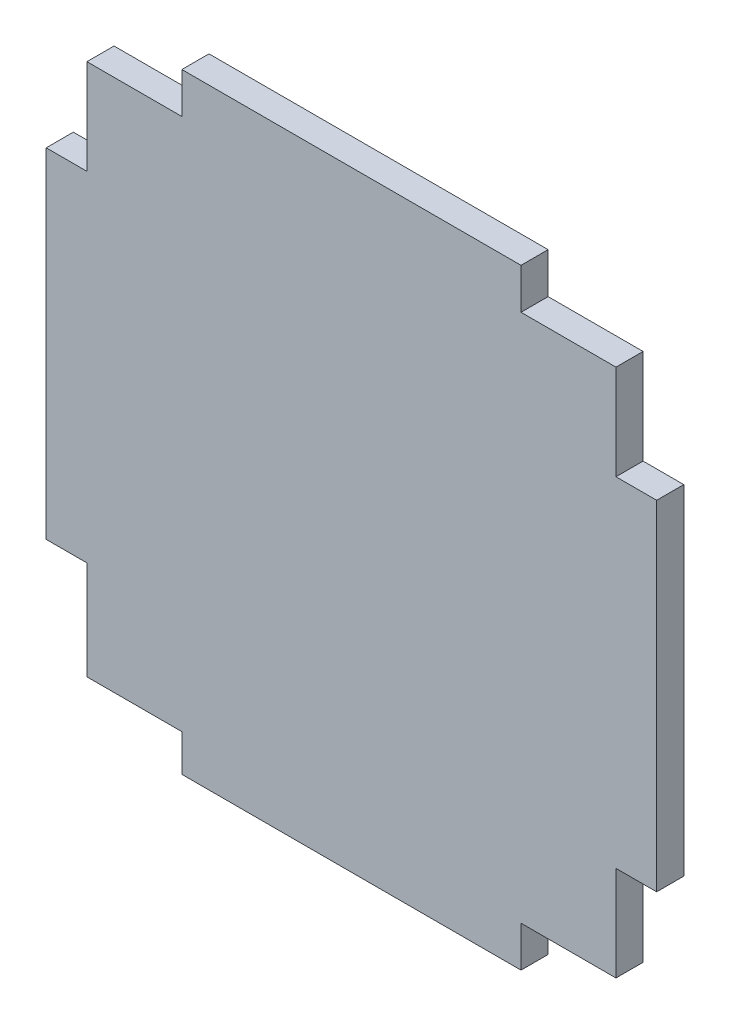
ISO-10303-21;
HEADER;
FILE_DESCRIPTION(('STEP AP214'),'2;1');
FILE_NAME('part.step','',(''),(''),'','','');
FILE_SCHEMA(('AUTOMOTIVE_DESIGN { 1 0 10303 214 1 1 1 1 }'));
ENDSEC;
DATA;
#1=APPLICATION_CONTEXT('core data for automotive mechanical design processes');
#2=APPLICATION_PROTOCOL_DEFINITION('international standard','automotive_design',2000,#1);
#3=PRODUCT_CONTEXT('',#1,'mechanical');
#4=PRODUCT('Part','Part','',(#3));
#5=PRODUCT_RELATED_PRODUCT_CATEGORY('part','',(#4));
#6=PRODUCT_DEFINITION_FORMATION('','',#4);
#7=PRODUCT_DEFINITION_CONTEXT('part definition',#1,'design');
#8=PRODUCT_DEFINITION('design','',#6,#7);
#9=PRODUCT_DEFINITION_SHAPE('','',#8);
#10=(LENGTH_UNIT() NAMED_UNIT(*) SI_UNIT(.MILLI.,.METRE.));
#11=(NAMED_UNIT(*) PLANE_ANGLE_UNIT() SI_UNIT($,.RADIAN.));
#12=(NAMED_UNIT(*) SI_UNIT($,.STERADIAN.) SOLID_ANGLE_UNIT());
#13=UNCERTAINTY_MEASURE_WITH_UNIT(LENGTH_MEASURE(1.E-05),#10,'distance_accuracy_value','');
#14=(GEOMETRIC_REPRESENTATION_CONTEXT(3) GLOBAL_UNCERTAINTY_ASSIGNED_CONTEXT((#13)) GLOBAL_UNIT_ASSIGNED_CONTEXT((#10,
#11,#12)) REPRESENTATION_CONTEXT('',''));
#15=CARTESIAN_POINT('',(0.,0.,0.));
#16=DIRECTION('',(0.,0.,1.));
#17=DIRECTION('',(1.,0.,0.));
#18=AXIS2_PLACEMENT_3D('',#15,#16,#17);
#19=CARTESIAN_POINT('',(22.5,-22.5,2.));
#20=DIRECTION('',(-1.,0.,0.));
#21=DIRECTION('',(0.,0.,1.));
#22=AXIS2_PLACEMENT_3D('',#19,#20,#21);
#23=PLANE('',#22);
#24=DIRECTION('',(0.,0.,1.));
#25=VECTOR('',#24,1.);
#26=CARTESIAN_POINT('',(22.5,12.5,-8.));
#27=LINE('',#26,#25);
#28=CARTESIAN_POINT('',(22.5,12.5,0.));
#29=VERTEX_POINT('',#28);
#30=CARTESIAN_POINT('',(22.5,12.5,2.));
#31=VERTEX_POINT('',#30);
#32=EDGE_CURVE('E216',#29,#31,#27,.T.);
#33=ORIENTED_EDGE('',*,*,#32,.T.);
#34=DIRECTION('',(0.,1.,0.));
#35=VECTOR('',#34,1.);
#36=CARTESIAN_POINT('',(22.5,-22.5,2.));
#37=LINE('',#36,#35);
#38=CARTESIAN_POINT('',(22.5,-12.5,2.));
#39=VERTEX_POINT('',#38);
#40=EDGE_CURVE('E210',#39,#31,#37,.T.);
#41=ORIENTED_EDGE('',*,*,#40,.F.);
#42=DIRECTION('',(0.,0.,1.));
#43=VECTOR('',#42,1.);
#44=CARTESIAN_POINT('',(22.5,-12.5,-8.));
#45=LINE('',#44,#43);
#46=CARTESIAN_POINT('',(22.5,-12.5,0.));
#47=VERTEX_POINT('',#46);
#48=EDGE_CURVE('E192',#47,#39,#45,.T.);
#49=ORIENTED_EDGE('',*,*,#48,.F.);
#50=DIRECTION('',(0.,1.,0.));
#51=VECTOR('',#50,1.);
#52=CARTESIAN_POINT('',(22.5,-22.5,0.));
#53=LINE('',#52,#51);
#54=EDGE_CURVE('E236',#47,#29,#53,.T.);
#55=ORIENTED_EDGE('',*,*,#54,.T.);
#56=EDGE_LOOP('',(#33,#41,#49,#55));
#57=FACE_BOUND('',#56,.T.);
#58=ADVANCED_FACE('F56',(#57),#23,.F.);
#59=CARTESIAN_POINT('',(-22.5,22.5,2.));
#60=DIRECTION('',(0.,-1.,0.));
#61=DIRECTION('',(0.,0.,-1.));
#62=AXIS2_PLACEMENT_3D('',#59,#60,#61);
#63=PLANE('',#62);
#64=DIRECTION('',(-1.,0.,0.));
#65=VECTOR('',#64,1.);
#66=CARTESIAN_POINT('',(-22.5,22.5,2.));
#67=LINE('',#66,#65);
#68=CARTESIAN_POINT('',(12.5,22.5,2.));
#69=VERTEX_POINT('',#68);
#70=CARTESIAN_POINT('',(-12.5,22.5,2.));
#71=VERTEX_POINT('',#70);
#72=EDGE_CURVE('E217',#69,#71,#67,.T.);
#73=ORIENTED_EDGE('',*,*,#72,.F.);
#74=DIRECTION('',(0.,0.,1.));
#75=VECTOR('',#74,1.);
#76=CARTESIAN_POINT('',(12.5,22.5,-8.));
#77=LINE('',#76,#75);
#78=CARTESIAN_POINT('',(12.5,22.5,0.));
#79=VERTEX_POINT('',#78);
#80=EDGE_CURVE('E298',#79,#69,#77,.T.);
#81=ORIENTED_EDGE('',*,*,#80,.F.);
#82=DIRECTION('',(-1.,0.,0.));
#83=VECTOR('',#82,1.);
#84=CARTESIAN_POINT('',(-22.5,22.5,0.));
#85=LINE('',#84,#83);
#86=CARTESIAN_POINT('',(-12.5,22.5,0.));
#87=VERTEX_POINT('',#86);
#88=EDGE_CURVE('E238',#79,#87,#85,.T.);
#89=ORIENTED_EDGE('',*,*,#88,.T.);
#90=DIRECTION('',(0.,0.,1.));
#91=VECTOR('',#90,1.);
#92=CARTESIAN_POINT('',(-12.5,22.5,-8.));
#93=LINE('',#92,#91);
#94=EDGE_CURVE('E355',#87,#71,#93,.T.);
#95=ORIENTED_EDGE('',*,*,#94,.T.);
#96=EDGE_LOOP('',(#73,#81,#89,#95));
#97=FACE_BOUND('',#96,.T.);
#98=ADVANCED_FACE('F302',(#97),#63,.F.);
#99=CARTESIAN_POINT('',(-22.5,-22.5,2.));
#100=DIRECTION('',(1.,0.,0.));
#101=DIRECTION('',(0.,0.,-1.));
#102=AXIS2_PLACEMENT_3D('',#99,#100,#101);
#103=PLANE('',#102);
#104=DIRECTION('',(0.,0.,1.));
#105=VECTOR('',#104,1.);
#106=CARTESIAN_POINT('',(-22.5,-12.5,-8.));
#107=LINE('',#106,#105);
#108=CARTESIAN_POINT('',(-22.5,-12.5,0.));
#109=VERTEX_POINT('',#108);
#110=CARTESIAN_POINT('',(-22.5,-12.5,2.));
#111=VERTEX_POINT('',#110);
#112=EDGE_CURVE('E329',#109,#111,#107,.T.);
#113=ORIENTED_EDGE('',*,*,#112,.T.);
#114=DIRECTION('',(0.,-1.,0.));
#115=VECTOR('',#114,1.);
#116=CARTESIAN_POINT('',(-22.5,-22.5,2.));
#117=LINE('',#116,#115);
#118=CARTESIAN_POINT('',(-22.5,12.5,2.));
#119=VERTEX_POINT('',#118);
#120=EDGE_CURVE('E221',#119,#111,#117,.T.);
#121=ORIENTED_EDGE('',*,*,#120,.F.);
#122=DIRECTION('',(0.,0.,1.));
#123=VECTOR('',#122,1.);
#124=CARTESIAN_POINT('',(-22.5,12.5,-8.));
#125=LINE('',#124,#123);
#126=CARTESIAN_POINT('',(-22.5,12.5,0.));
#127=VERTEX_POINT('',#126);
#128=EDGE_CURVE('E353',#127,#119,#125,.T.);
#129=ORIENTED_EDGE('',*,*,#128,.F.);
#130=DIRECTION('',(0.,-1.,0.));
#131=VECTOR('',#130,1.);
#132=CARTESIAN_POINT('',(-22.5,-22.5,0.));
#133=LINE('',#132,#131);
#134=EDGE_CURVE('E224',#127,#109,#133,.T.);
#135=ORIENTED_EDGE('',*,*,#134,.T.);
#136=EDGE_LOOP('',(#113,#121,#129,#135));
#137=FACE_BOUND('',#136,.T.);
#138=ADVANCED_FACE('F377',(#137),#103,.F.);
#139=CARTESIAN_POINT('',(-22.5,-22.5,2.));
#140=DIRECTION('',(0.,1.,0.));
#141=DIRECTION('',(0.,0.,1.));
#142=AXIS2_PLACEMENT_3D('',#139,#140,#141);
#143=PLANE('',#142);
#144=DIRECTION('',(1.,0.,0.));
#145=VECTOR('',#144,1.);
#146=CARTESIAN_POINT('',(-22.5,-22.5,2.));
#147=LINE('',#146,#145);
#148=CARTESIAN_POINT('',(-12.5,-22.5,2.));
#149=VERTEX_POINT('',#148);
#150=CARTESIAN_POINT('',(12.5,-22.5,2.));
#151=VERTEX_POINT('',#150);
#152=EDGE_CURVE('E232',#149,#151,#147,.T.);
#153=ORIENTED_EDGE('',*,*,#152,.F.);
#154=DIRECTION('',(0.,0.,1.));
#155=VECTOR('',#154,1.);
#156=CARTESIAN_POINT('',(-12.5,-22.5,-8.));
#157=LINE('',#156,#155);
#158=CARTESIAN_POINT('',(-12.5,-22.5,0.));
#159=VERTEX_POINT('',#158);
#160=EDGE_CURVE('E321',#159,#149,#157,.T.);
#161=ORIENTED_EDGE('',*,*,#160,.F.);
#162=DIRECTION('',(1.,0.,0.));
#163=VECTOR('',#162,1.);
#164=CARTESIAN_POINT('',(-22.5,-22.5,0.));
#165=LINE('',#164,#163);
#166=CARTESIAN_POINT('',(12.5,-22.5,0.));
#167=VERTEX_POINT('',#166);
#168=EDGE_CURVE('E218',#159,#167,#165,.T.);
#169=ORIENTED_EDGE('',*,*,#168,.T.);
#170=DIRECTION('',(0.,0.,1.));
#171=VECTOR('',#170,1.);
#172=CARTESIAN_POINT('',(12.5,-22.5,-8.));
#173=LINE('',#172,#171);
#174=EDGE_CURVE('E398',#167,#151,#173,.T.);
#175=ORIENTED_EDGE('',*,*,#174,.T.);
#176=EDGE_LOOP('',(#153,#161,#169,#175));
#177=FACE_BOUND('',#176,.T.);
#178=ADVANCED_FACE('F396',(#177),#143,.F.);
#179=CARTESIAN_POINT('',(0.,0.,2.));
#180=DIRECTION('',(0.,0.,-1.));
#181=DIRECTION('',(-1.,0.,0.));
#182=AXIS2_PLACEMENT_3D('',#179,#180,#181);
#183=PLANE('',#182);
#184=DIRECTION('',(-1.,0.,0.));
#185=VECTOR('',#184,1.);
#186=CARTESIAN_POINT('',(0.,12.5,2.));
#187=LINE('',#186,#185);
#188=CARTESIAN_POINT('',(19.5,12.5,2.));
#189=VERTEX_POINT('',#188);
#190=EDGE_CURVE('E304',#31,#189,#187,.T.);
#191=ORIENTED_EDGE('',*,*,#190,.T.);
#192=DIRECTION('',(0.,-1.,0.));
#193=VECTOR('',#192,1.);
#194=CARTESIAN_POINT('',(19.5,0.,2.));
#195=LINE('',#194,#193);
#196=CARTESIAN_POINT('',(19.5,19.5,2.));
#197=VERTEX_POINT('',#196);
#198=EDGE_CURVE('E306',#197,#189,#195,.T.);
#199=ORIENTED_EDGE('',*,*,#198,.F.);
#200=DIRECTION('',(-1.,0.,0.));
#201=VECTOR('',#200,1.);
#202=CARTESIAN_POINT('',(0.,19.5,2.));
#203=LINE('',#202,#201);
#204=CARTESIAN_POINT('',(12.5,19.5,2.));
#205=VERTEX_POINT('',#204);
#206=EDGE_CURVE('E291',#197,#205,#203,.T.);
#207=ORIENTED_EDGE('',*,*,#206,.T.);
#208=DIRECTION('',(0.,-1.,0.));
#209=VECTOR('',#208,1.);
#210=CARTESIAN_POINT('',(12.5,0.,2.));
#211=LINE('',#210,#209);
#212=EDGE_CURVE('E318',#69,#205,#211,.T.);
#213=ORIENTED_EDGE('',*,*,#212,.F.);
#214=ORIENTED_EDGE('',*,*,#72,.T.);
#215=DIRECTION('',(0.,-1.,0.));
#216=VECTOR('',#215,1.);
#217=CARTESIAN_POINT('',(-12.5,0.,2.));
#218=LINE('',#217,#216);
#219=CARTESIAN_POINT('',(-12.5,19.5,2.));
#220=VERTEX_POINT('',#219);
#221=EDGE_CURVE('E346',#71,#220,#218,.T.);
#222=ORIENTED_EDGE('',*,*,#221,.T.);
#223=DIRECTION('',(1.,0.,0.));
#224=VECTOR('',#223,1.);
#225=CARTESIAN_POINT('',(0.,19.5,2.));
#226=LINE('',#225,#224);
#227=CARTESIAN_POINT('',(-19.5,19.5,2.));
#228=VERTEX_POINT('',#227);
#229=EDGE_CURVE('E343',#228,#220,#226,.T.);
#230=ORIENTED_EDGE('',*,*,#229,.F.);
#231=DIRECTION('',(0.,-1.,0.));
#232=VECTOR('',#231,1.);
#233=CARTESIAN_POINT('',(-19.5,0.,2.));
#234=LINE('',#233,#232);
#235=CARTESIAN_POINT('',(-19.5,12.5,2.));
#236=VERTEX_POINT('',#235);
#237=EDGE_CURVE('E320',#228,#236,#234,.T.);
#238=ORIENTED_EDGE('',*,*,#237,.T.);
#239=DIRECTION('',(1.,0.,0.));
#240=VECTOR('',#239,1.);
#241=CARTESIAN_POINT('',(0.,12.5,2.));
#242=LINE('',#241,#240);
#243=EDGE_CURVE('E349',#119,#236,#242,.T.);
#244=ORIENTED_EDGE('',*,*,#243,.F.);
#245=ORIENTED_EDGE('',*,*,#120,.T.);
#246=DIRECTION('',(1.,0.,0.));
#247=VECTOR('',#246,1.);
#248=CARTESIAN_POINT('',(0.,-12.5,2.));
#249=LINE('',#248,#247);
#250=CARTESIAN_POINT('',(-19.5,-12.5,2.));
#251=VERTEX_POINT('',#250);
#252=EDGE_CURVE('E323',#111,#251,#249,.T.);
#253=ORIENTED_EDGE('',*,*,#252,.T.);
#254=DIRECTION('',(0.,1.,0.));
#255=VECTOR('',#254,1.);
#256=CARTESIAN_POINT('',(-19.5,0.,2.));
#257=LINE('',#256,#255);
#258=CARTESIAN_POINT('',(-19.5,-19.7735250601967,2.));
#259=VERTEX_POINT('',#258);
#260=EDGE_CURVE('E334',#259,#251,#257,.T.);
#261=ORIENTED_EDGE('',*,*,#260,.F.);
#262=DIRECTION('',(1.,0.,0.));
#263=VECTOR('',#262,1.);
#264=CARTESIAN_POINT('',(0.,-19.7735250601967,2.));
#265=LINE('',#264,#263);
#266=CARTESIAN_POINT('',(-12.5,-19.7735250601967,2.));
#267=VERTEX_POINT('',#266);
#268=EDGE_CURVE('E337',#259,#267,#265,.T.);
#269=ORIENTED_EDGE('',*,*,#268,.T.);
#270=DIRECTION('',(0.,1.,0.));
#271=VECTOR('',#270,1.);
#272=CARTESIAN_POINT('',(-12.5,0.,2.));
#273=LINE('',#272,#271);
#274=EDGE_CURVE('E314',#149,#267,#273,.T.);
#275=ORIENTED_EDGE('',*,*,#274,.F.);
#276=ORIENTED_EDGE('',*,*,#152,.T.);
#277=DIRECTION('',(0.,1.,0.));
#278=VECTOR('',#277,1.);
#279=CARTESIAN_POINT('',(12.5,0.,2.));
#280=LINE('',#279,#278);
#281=CARTESIAN_POINT('',(12.5,-19.5,2.));
#282=VERTEX_POINT('',#281);
#283=EDGE_CURVE('E310',#151,#282,#280,.T.);
#284=ORIENTED_EDGE('',*,*,#283,.T.);
#285=DIRECTION('',(-1.,0.,0.));
#286=VECTOR('',#285,1.);
#287=CARTESIAN_POINT('',(0.,-19.5,2.));
#288=LINE('',#287,#286);
#289=CARTESIAN_POINT('',(19.5,-19.5,2.));
#290=VERTEX_POINT('',#289);
#291=EDGE_CURVE('E400',#290,#282,#288,.T.);
#292=ORIENTED_EDGE('',*,*,#291,.F.);
#293=DIRECTION('',(0.,1.,0.));
#294=VECTOR('',#293,1.);
#295=CARTESIAN_POINT('',(19.5,-22.5,2.));
#296=LINE('',#295,#294);
#297=CARTESIAN_POINT('',(19.5,-12.5,2.));
#298=VERTEX_POINT('',#297);
#299=EDGE_CURVE('E213',#290,#298,#296,.T.);
#300=ORIENTED_EDGE('',*,*,#299,.T.);
#301=DIRECTION('',(-1.,0.,0.));
#302=VECTOR('',#301,1.);
#303=CARTESIAN_POINT('',(22.5,-12.5,2.));
#304=LINE('',#303,#302);
#305=EDGE_CURVE('E196',#39,#298,#304,.T.);
#306=ORIENTED_EDGE('',*,*,#305,.F.);
#307=ORIENTED_EDGE('',*,*,#40,.T.);
#308=EDGE_LOOP('',(#191,#199,#207,#213,#214,#222,#230,#238,#244,#245,#253,#261,#269,#275,#276,
#284,#292,#300,#306,#307));
#309=FACE_BOUND('',#308,.T.);
#310=ADVANCED_FACE('F209',(#309),#183,.F.);
#311=CARTESIAN_POINT('',(0.,0.,0.));
#312=DIRECTION('',(0.,0.,-1.));
#313=DIRECTION('',(-1.,0.,0.));
#314=AXIS2_PLACEMENT_3D('',#311,#312,#313);
#315=PLANE('',#314);
#316=DIRECTION('',(0.,1.,0.));
#317=VECTOR('',#316,1.);
#318=CARTESIAN_POINT('',(19.5,0.,0.));
#319=LINE('',#318,#317);
#320=CARTESIAN_POINT('',(19.5,12.5,0.));
#321=VERTEX_POINT('',#320);
#322=CARTESIAN_POINT('',(19.5,19.5,0.));
#323=VERTEX_POINT('',#322);
#324=EDGE_CURVE('E63',#321,#323,#319,.T.);
#325=ORIENTED_EDGE('',*,*,#324,.F.);
#326=DIRECTION('',(1.,0.,0.));
#327=VECTOR('',#326,1.);
#328=CARTESIAN_POINT('',(0.,12.5,0.));
#329=LINE('',#328,#327);
#330=EDGE_CURVE('E12',#321,#29,#329,.T.);
#331=ORIENTED_EDGE('',*,*,#330,.T.);
#332=ORIENTED_EDGE('',*,*,#54,.F.);
#333=DIRECTION('',(1.,0.,0.));
#334=VECTOR('',#333,1.);
#335=CARTESIAN_POINT('',(0.,-12.5,0.));
#336=LINE('',#335,#334);
#337=CARTESIAN_POINT('',(19.5,-12.5,0.));
#338=VERTEX_POINT('',#337);
#339=EDGE_CURVE('E199',#338,#47,#336,.T.);
#340=ORIENTED_EDGE('',*,*,#339,.F.);
#341=DIRECTION('',(0.,-1.,0.));
#342=VECTOR('',#341,1.);
#343=CARTESIAN_POINT('',(19.5,0.,0.));
#344=LINE('',#343,#342);
#345=CARTESIAN_POINT('',(19.5,-19.5,0.));
#346=VERTEX_POINT('',#345);
#347=EDGE_CURVE('E253',#338,#346,#344,.T.);
#348=ORIENTED_EDGE('',*,*,#347,.T.);
#349=DIRECTION('',(1.,0.,0.));
#350=VECTOR('',#349,1.);
#351=CARTESIAN_POINT('',(0.,-19.5,0.));
#352=LINE('',#351,#350);
#353=CARTESIAN_POINT('',(12.5,-19.5,0.));
#354=VERTEX_POINT('',#353);
#355=EDGE_CURVE('E257',#354,#346,#352,.T.);
#356=ORIENTED_EDGE('',*,*,#355,.F.);
#357=DIRECTION('',(0.,-1.,0.));
#358=VECTOR('',#357,1.);
#359=CARTESIAN_POINT('',(12.5,0.,0.));
#360=LINE('',#359,#358);
#361=EDGE_CURVE('E260',#354,#167,#360,.T.);
#362=ORIENTED_EDGE('',*,*,#361,.T.);
#363=ORIENTED_EDGE('',*,*,#168,.F.);
#364=DIRECTION('',(0.,-1.,0.));
#365=VECTOR('',#364,1.);
#366=CARTESIAN_POINT('',(-12.5,0.,0.));
#367=LINE('',#366,#365);
#368=CARTESIAN_POINT('',(-12.5,-19.7735250601967,0.));
#369=VERTEX_POINT('',#368);
#370=EDGE_CURVE('E263',#369,#159,#367,.T.);
#371=ORIENTED_EDGE('',*,*,#370,.F.);
#372=DIRECTION('',(-1.,0.,0.));
#373=VECTOR('',#372,1.);
#374=CARTESIAN_POINT('',(0.,-19.7735250601967,0.));
#375=LINE('',#374,#373);
#376=CARTESIAN_POINT('',(-19.5,-19.7735250601967,0.));
#377=VERTEX_POINT('',#376);
#378=EDGE_CURVE('E265',#369,#377,#375,.T.);
#379=ORIENTED_EDGE('',*,*,#378,.T.);
#380=DIRECTION('',(0.,-1.,0.));
#381=VECTOR('',#380,1.);
#382=CARTESIAN_POINT('',(-19.5,0.,0.));
#383=LINE('',#382,#381);
#384=CARTESIAN_POINT('',(-19.5,-12.5,0.));
#385=VERTEX_POINT('',#384);
#386=EDGE_CURVE('E268',#385,#377,#383,.T.);
#387=ORIENTED_EDGE('',*,*,#386,.F.);
#388=DIRECTION('',(-1.,0.,0.));
#389=VECTOR('',#388,1.);
#390=CARTESIAN_POINT('',(0.,-12.5,0.));
#391=LINE('',#390,#389);
#392=EDGE_CURVE('E270',#385,#109,#391,.T.);
#393=ORIENTED_EDGE('',*,*,#392,.T.);
#394=ORIENTED_EDGE('',*,*,#134,.F.);
#395=DIRECTION('',(-1.,0.,0.));
#396=VECTOR('',#395,1.);
#397=CARTESIAN_POINT('',(0.,12.5,0.));
#398=LINE('',#397,#396);
#399=CARTESIAN_POINT('',(-19.5,12.5,0.));
#400=VERTEX_POINT('',#399);
#401=EDGE_CURVE('E251',#400,#127,#398,.T.);
#402=ORIENTED_EDGE('',*,*,#401,.F.);
#403=DIRECTION('',(0.,1.,0.));
#404=VECTOR('',#403,1.);
#405=CARTESIAN_POINT('',(-19.5,0.,0.));
#406=LINE('',#405,#404);
#407=CARTESIAN_POINT('',(-19.5,19.5,0.));
#408=VERTEX_POINT('',#407);
#409=EDGE_CURVE('E248',#400,#408,#406,.T.);
#410=ORIENTED_EDGE('',*,*,#409,.T.);
#411=DIRECTION('',(-1.,0.,0.));
#412=VECTOR('',#411,1.);
#413=CARTESIAN_POINT('',(0.,19.5,0.));
#414=LINE('',#413,#412);
#415=CARTESIAN_POINT('',(-12.5,19.5,0.));
#416=VERTEX_POINT('',#415);
#417=EDGE_CURVE('E235',#416,#408,#414,.T.);
#418=ORIENTED_EDGE('',*,*,#417,.F.);
#419=DIRECTION('',(0.,1.,0.));
#420=VECTOR('',#419,1.);
#421=CARTESIAN_POINT('',(-12.5,0.,0.));
#422=LINE('',#421,#420);
#423=EDGE_CURVE('E245',#416,#87,#422,.T.);
#424=ORIENTED_EDGE('',*,*,#423,.T.);
#425=ORIENTED_EDGE('',*,*,#88,.F.);
#426=DIRECTION('',(0.,1.,0.));
#427=VECTOR('',#426,1.);
#428=CARTESIAN_POINT('',(12.5,0.,0.));
#429=LINE('',#428,#427);
#430=CARTESIAN_POINT('',(12.5,19.5,0.));
#431=VERTEX_POINT('',#430);
#432=EDGE_CURVE('E273',#431,#79,#429,.T.);
#433=ORIENTED_EDGE('',*,*,#432,.F.);
#434=DIRECTION('',(1.,0.,0.));
#435=VECTOR('',#434,1.);
#436=CARTESIAN_POINT('',(0.,19.5,0.));
#437=LINE('',#436,#435);
#438=EDGE_CURVE('E275',#431,#323,#437,.T.);
#439=ORIENTED_EDGE('',*,*,#438,.T.);
#440=EDGE_LOOP('',(#325,#331,#332,#340,#348,#356,#362,#363,#371,#379,#387,#393,#394,#402,#410,
#418,#424,#425,#433,#439));
#441=FACE_BOUND('',#440,.T.);
#442=ADVANCED_FACE('F294',(#441),#315,.T.);
#443=CARTESIAN_POINT('',(-19.5,0.,-8.));
#444=DIRECTION('',(-1.,0.,0.));
#445=DIRECTION('',(0.,-1.,0.));
#446=AXIS2_PLACEMENT_3D('',#443,#444,#445);
#447=PLANE('',#446);
#448=DIRECTION('',(0.,0.,1.));
#449=VECTOR('',#448,1.);
#450=CARTESIAN_POINT('',(-19.5,12.5,-8.));
#451=LINE('',#450,#449);
#452=EDGE_CURVE('E239',#400,#236,#451,.T.);
#453=ORIENTED_EDGE('',*,*,#452,.T.);
#454=ORIENTED_EDGE('',*,*,#237,.F.);
#455=DIRECTION('',(0.,0.,1.));
#456=VECTOR('',#455,1.);
#457=CARTESIAN_POINT('',(-19.5,19.5,-8.));
#458=LINE('',#457,#456);
#459=EDGE_CURVE('E227',#408,#228,#458,.T.);
#460=ORIENTED_EDGE('',*,*,#459,.F.);
#461=ORIENTED_EDGE('',*,*,#409,.F.);
#462=EDGE_LOOP('',(#453,#454,#460,#461));
#463=FACE_BOUND('',#462,.T.);
#464=ADVANCED_FACE('F366',(#463),#447,.T.);
#465=CARTESIAN_POINT('',(0.,12.5,-8.));
#466=DIRECTION('',(0.,-1.,0.));
#467=DIRECTION('',(0.,0.,-1.));
#468=AXIS2_PLACEMENT_3D('',#465,#466,#467);
#469=PLANE('',#468);
#470=ORIENTED_EDGE('',*,*,#401,.T.);
#471=ORIENTED_EDGE('',*,*,#128,.T.);
#472=ORIENTED_EDGE('',*,*,#243,.T.);
#473=ORIENTED_EDGE('',*,*,#452,.F.);
#474=EDGE_LOOP('',(#470,#471,#472,#473));
#475=FACE_BOUND('',#474,.T.);
#476=ADVANCED_FACE('F373',(#475),#469,.F.);
#477=CARTESIAN_POINT('',(-12.5,0.,-8.));
#478=DIRECTION('',(-1.,0.,0.));
#479=DIRECTION('',(0.,-1.,0.));
#480=AXIS2_PLACEMENT_3D('',#477,#478,#479);
#481=PLANE('',#480);
#482=DIRECTION('',(0.,0.,1.));
#483=VECTOR('',#482,1.);
#484=CARTESIAN_POINT('',(-12.5,19.5,-8.));
#485=LINE('',#484,#483);
#486=EDGE_CURVE('E356',#416,#220,#485,.T.);
#487=ORIENTED_EDGE('',*,*,#486,.T.);
#488=ORIENTED_EDGE('',*,*,#221,.F.);
#489=ORIENTED_EDGE('',*,*,#94,.F.);
#490=ORIENTED_EDGE('',*,*,#423,.F.);
#491=EDGE_LOOP('',(#487,#488,#489,#490));
#492=FACE_BOUND('',#491,.T.);
#493=ADVANCED_FACE('F369',(#492),#481,.T.);
#494=CARTESIAN_POINT('',(0.,19.5,-8.));
#495=DIRECTION('',(0.,-1.,0.));
#496=DIRECTION('',(0.,0.,-1.));
#497=AXIS2_PLACEMENT_3D('',#494,#495,#496);
#498=PLANE('',#497);
#499=ORIENTED_EDGE('',*,*,#417,.T.);
#500=ORIENTED_EDGE('',*,*,#459,.T.);
#501=ORIENTED_EDGE('',*,*,#229,.T.);
#502=ORIENTED_EDGE('',*,*,#486,.F.);
#503=EDGE_LOOP('',(#499,#500,#501,#502));
#504=FACE_BOUND('',#503,.T.);
#505=ADVANCED_FACE('F362',(#504),#498,.F.);
#506=CARTESIAN_POINT('',(12.5,0.,-8.));
#507=DIRECTION('',(1.,0.,0.));
#508=DIRECTION('',(0.,0.,-1.));
#509=AXIS2_PLACEMENT_3D('',#506,#507,#508);
#510=PLANE('',#509);
#511=DIRECTION('',(0.,0.,1.));
#512=VECTOR('',#511,1.);
#513=CARTESIAN_POINT('',(12.5,-19.5,-8.));
#514=LINE('',#513,#512);
#515=EDGE_CURVE('E404',#354,#282,#514,.T.);
#516=ORIENTED_EDGE('',*,*,#515,.T.);
#517=ORIENTED_EDGE('',*,*,#283,.F.);
#518=ORIENTED_EDGE('',*,*,#174,.F.);
#519=ORIENTED_EDGE('',*,*,#361,.F.);
#520=EDGE_LOOP('',(#516,#517,#518,#519));
#521=FACE_BOUND('',#520,.T.);
#522=ADVANCED_FACE('F409',(#521),#510,.T.);
#523=CARTESIAN_POINT('',(0.,-19.5,-8.));
#524=DIRECTION('',(0.,1.,0.));
#525=DIRECTION('',(-1.,0.,0.));
#526=AXIS2_PLACEMENT_3D('',#523,#524,#525);
#527=PLANE('',#526);
#528=ORIENTED_EDGE('',*,*,#355,.T.);
#529=DIRECTION('',(0.,0.,1.));
#530=VECTOR('',#529,1.);
#531=CARTESIAN_POINT('',(19.5,-19.5,-8.));
#532=LINE('',#531,#530);
#533=EDGE_CURVE('E401',#346,#290,#532,.T.);
#534=ORIENTED_EDGE('',*,*,#533,.T.);
#535=ORIENTED_EDGE('',*,*,#291,.T.);
#536=ORIENTED_EDGE('',*,*,#515,.F.);
#537=EDGE_LOOP('',(#528,#534,#535,#536));
#538=FACE_BOUND('',#537,.T.);
#539=ADVANCED_FACE('F412',(#538),#527,.F.);
#540=CARTESIAN_POINT('',(22.5,-12.5,-8.));
#541=DIRECTION('',(0.,1.,0.));
#542=DIRECTION('',(0.,0.,1.));
#543=AXIS2_PLACEMENT_3D('',#540,#541,#542);
#544=PLANE('',#543);
#545=ORIENTED_EDGE('',*,*,#339,.T.);
#546=ORIENTED_EDGE('',*,*,#48,.T.);
#547=ORIENTED_EDGE('',*,*,#305,.T.);
#548=DIRECTION('',(0.,0.,1.));
#549=VECTOR('',#548,1.);
#550=CARTESIAN_POINT('',(19.5,-12.5,-8.));
#551=LINE('',#550,#549);
#552=EDGE_CURVE('E204',#338,#298,#551,.T.);
#553=ORIENTED_EDGE('',*,*,#552,.F.);
#554=EDGE_LOOP('',(#545,#546,#547,#553));
#555=FACE_BOUND('',#554,.T.);
#556=ADVANCED_FACE('F194',(#555),#544,.F.);
#557=CARTESIAN_POINT('',(19.5,-22.5,-8.));
#558=DIRECTION('',(1.,0.,0.));
#559=DIRECTION('',(0.,0.,-1.));
#560=AXIS2_PLACEMENT_3D('',#557,#558,#559);
#561=PLANE('',#560);
#562=ORIENTED_EDGE('',*,*,#552,.T.);
#563=ORIENTED_EDGE('',*,*,#299,.F.);
#564=ORIENTED_EDGE('',*,*,#533,.F.);
#565=ORIENTED_EDGE('',*,*,#347,.F.);
#566=EDGE_LOOP('',(#562,#563,#564,#565));
#567=FACE_BOUND('',#566,.T.);
#568=ADVANCED_FACE('F415',(#567),#561,.T.);
#569=CARTESIAN_POINT('',(0.,-12.5,-8.));
#570=DIRECTION('',(0.,-1.,0.));
#571=DIRECTION('',(0.,0.,-1.));
#572=AXIS2_PLACEMENT_3D('',#569,#570,#571);
#573=PLANE('',#572);
#574=DIRECTION('',(0.,0.,1.));
#575=VECTOR('',#574,1.);
#576=CARTESIAN_POINT('',(-19.5,-12.5,-8.));
#577=LINE('',#576,#575);
#578=EDGE_CURVE('E327',#385,#251,#577,.T.);
#579=ORIENTED_EDGE('',*,*,#578,.T.);
#580=ORIENTED_EDGE('',*,*,#252,.F.);
#581=ORIENTED_EDGE('',*,*,#112,.F.);
#582=ORIENTED_EDGE('',*,*,#392,.F.);
#583=EDGE_LOOP('',(#579,#580,#581,#582));
#584=FACE_BOUND('',#583,.T.);
#585=ADVANCED_FACE('F379',(#584),#573,.T.);
#586=CARTESIAN_POINT('',(-19.5,0.,-8.));
#587=DIRECTION('',(1.,0.,0.));
#588=DIRECTION('',(0.,0.,-1.));
#589=AXIS2_PLACEMENT_3D('',#586,#587,#588);
#590=PLANE('',#589);
#591=ORIENTED_EDGE('',*,*,#386,.T.);
#592=DIRECTION('',(0.,0.,1.));
#593=VECTOR('',#592,1.);
#594=CARTESIAN_POINT('',(-19.5,-19.7735250601967,-8.));
#595=LINE('',#594,#593);
#596=EDGE_CURVE('E325',#377,#259,#595,.T.);
#597=ORIENTED_EDGE('',*,*,#596,.T.);
#598=ORIENTED_EDGE('',*,*,#260,.T.);
#599=ORIENTED_EDGE('',*,*,#578,.F.);
#600=EDGE_LOOP('',(#591,#597,#598,#599));
#601=FACE_BOUND('',#600,.T.);
#602=ADVANCED_FACE('F385',(#601),#590,.F.);
#603=CARTESIAN_POINT('',(0.,-19.7735250601967,-8.));
#604=DIRECTION('',(0.,-1.,0.));
#605=DIRECTION('',(0.,0.,-1.));
#606=AXIS2_PLACEMENT_3D('',#603,#604,#605);
#607=PLANE('',#606);
#608=DIRECTION('',(0.,0.,1.));
#609=VECTOR('',#608,1.);
#610=CARTESIAN_POINT('',(-12.5,-19.7735250601967,-8.));
#611=LINE('',#610,#609);
#612=EDGE_CURVE('E78',#369,#267,#611,.T.);
#613=ORIENTED_EDGE('',*,*,#612,.T.);
#614=ORIENTED_EDGE('',*,*,#268,.F.);
#615=ORIENTED_EDGE('',*,*,#596,.F.);
#616=ORIENTED_EDGE('',*,*,#378,.F.);
#617=EDGE_LOOP('',(#613,#614,#615,#616));
#618=FACE_BOUND('',#617,.T.);
#619=ADVANCED_FACE('F388',(#618),#607,.T.);
#620=CARTESIAN_POINT('',(-12.5,0.,-8.));
#621=DIRECTION('',(1.,0.,0.));
#622=DIRECTION('',(0.,0.,-1.));
#623=AXIS2_PLACEMENT_3D('',#620,#621,#622);
#624=PLANE('',#623);
#625=ORIENTED_EDGE('',*,*,#370,.T.);
#626=ORIENTED_EDGE('',*,*,#160,.T.);
#627=ORIENTED_EDGE('',*,*,#274,.T.);
#628=ORIENTED_EDGE('',*,*,#612,.F.);
#629=EDGE_LOOP('',(#625,#626,#627,#628));
#630=FACE_BOUND('',#629,.T.);
#631=ADVANCED_FACE('F419',(#630),#624,.F.);
#632=CARTESIAN_POINT('',(0.,12.5,-8.));
#633=DIRECTION('',(0.,1.,0.));
#634=DIRECTION('',(0.,0.,1.));
#635=AXIS2_PLACEMENT_3D('',#632,#633,#634);
#636=PLANE('',#635);
#637=DIRECTION('',(0.,0.,1.));
#638=VECTOR('',#637,1.);
#639=CARTESIAN_POINT('',(19.5,12.5,-8.));
#640=LINE('',#639,#638);
#641=EDGE_CURVE('E285',#321,#189,#640,.T.);
#642=ORIENTED_EDGE('',*,*,#641,.T.);
#643=ORIENTED_EDGE('',*,*,#190,.F.);
#644=ORIENTED_EDGE('',*,*,#32,.F.);
#645=ORIENTED_EDGE('',*,*,#330,.F.);
#646=EDGE_LOOP('',(#642,#643,#644,#645));
#647=FACE_BOUND('',#646,.T.);
#648=ADVANCED_FACE('F417',(#647),#636,.T.);
#649=CARTESIAN_POINT('',(19.5,0.,-8.));
#650=DIRECTION('',(-1.,0.,0.));
#651=DIRECTION('',(0.,0.,1.));
#652=AXIS2_PLACEMENT_3D('',#649,#650,#651);
#653=PLANE('',#652);
#654=ORIENTED_EDGE('',*,*,#324,.T.);
#655=DIRECTION('',(0.,0.,1.));
#656=VECTOR('',#655,1.);
#657=CARTESIAN_POINT('',(19.5,19.5,-8.));
#658=LINE('',#657,#656);
#659=EDGE_CURVE('E283',#323,#197,#658,.T.);
#660=ORIENTED_EDGE('',*,*,#659,.T.);
#661=ORIENTED_EDGE('',*,*,#198,.T.);
#662=ORIENTED_EDGE('',*,*,#641,.F.);
#663=EDGE_LOOP('',(#654,#660,#661,#662));
#664=FACE_BOUND('',#663,.T.);
#665=ADVANCED_FACE('F281',(#664),#653,.F.);
#666=CARTESIAN_POINT('',(0.,19.5,-8.));
#667=DIRECTION('',(0.,1.,0.));
#668=DIRECTION('',(0.,0.,1.));
#669=AXIS2_PLACEMENT_3D('',#666,#667,#668);
#670=PLANE('',#669);
#671=DIRECTION('',(0.,0.,1.));
#672=VECTOR('',#671,1.);
#673=CARTESIAN_POINT('',(12.5,19.5,-8.));
#674=LINE('',#673,#672);
#675=EDGE_CURVE('E70',#431,#205,#674,.T.);
#676=ORIENTED_EDGE('',*,*,#675,.T.);
#677=ORIENTED_EDGE('',*,*,#206,.F.);
#678=ORIENTED_EDGE('',*,*,#659,.F.);
#679=ORIENTED_EDGE('',*,*,#438,.F.);
#680=EDGE_LOOP('',(#676,#677,#678,#679));
#681=FACE_BOUND('',#680,.T.);
#682=ADVANCED_FACE('F288',(#681),#670,.T.);
#683=CARTESIAN_POINT('',(12.5,0.,-8.));
#684=DIRECTION('',(-1.,0.,0.));
#685=DIRECTION('',(0.,0.,1.));
#686=AXIS2_PLACEMENT_3D('',#683,#684,#685);
#687=PLANE('',#686);
#688=ORIENTED_EDGE('',*,*,#432,.T.);
#689=ORIENTED_EDGE('',*,*,#80,.T.);
#690=ORIENTED_EDGE('',*,*,#212,.T.);
#691=ORIENTED_EDGE('',*,*,#675,.F.);
#692=EDGE_LOOP('',(#688,#689,#690,#691));
#693=FACE_BOUND('',#692,.T.);
#694=ADVANCED_FACE('F297',(#693),#687,.F.);
#695=CLOSED_SHELL('',(#58,#98,#138,#178,#310,#442,#464,#476,#493,#505,#522,#539,#556,#568,#585,
#602,#619,#631,#648,#665,#682,#694));
#696=MANIFOLD_SOLID_BREP('B2',#695);
#697=ADVANCED_BREP_SHAPE_REPRESENTATION('',(#18,#696),#14);
#698=SHAPE_DEFINITION_REPRESENTATION(#9,#697);
ENDSEC;
END-ISO-10303-21;
